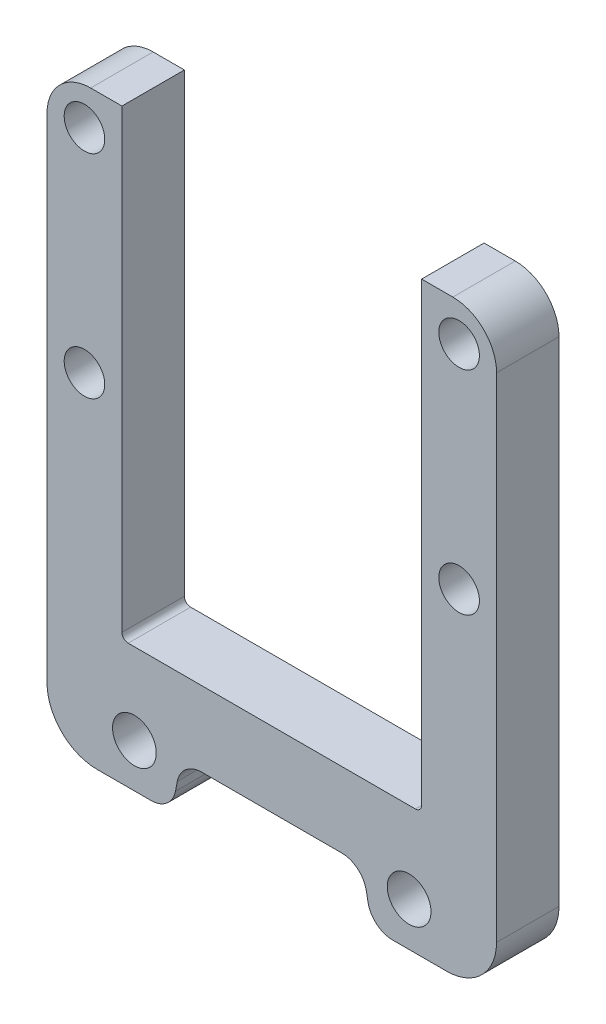
ISO-10303-21;
HEADER;
FILE_DESCRIPTION(('STEP AP214'),'2;1');
FILE_NAME('part.step','',(''),(''),'','','');
FILE_SCHEMA(('AUTOMOTIVE_DESIGN { 1 0 10303 214 1 1 1 1 }'));
ENDSEC;
DATA;
#1=APPLICATION_CONTEXT('core data for automotive mechanical design processes');
#2=APPLICATION_PROTOCOL_DEFINITION('international standard','automotive_design',2000,#1);
#3=PRODUCT_CONTEXT('',#1,'mechanical');
#4=PRODUCT('Part','Part','',(#3));
#5=PRODUCT_RELATED_PRODUCT_CATEGORY('part','',(#4));
#6=PRODUCT_DEFINITION_FORMATION('','',#4);
#7=PRODUCT_DEFINITION_CONTEXT('part definition',#1,'design');
#8=PRODUCT_DEFINITION('design','',#6,#7);
#9=PRODUCT_DEFINITION_SHAPE('','',#8);
#10=(LENGTH_UNIT() NAMED_UNIT(*) SI_UNIT(.MILLI.,.METRE.));
#11=(NAMED_UNIT(*) PLANE_ANGLE_UNIT() SI_UNIT($,.RADIAN.));
#12=(NAMED_UNIT(*) SI_UNIT($,.STERADIAN.) SOLID_ANGLE_UNIT());
#13=UNCERTAINTY_MEASURE_WITH_UNIT(LENGTH_MEASURE(1.E-05),#10,'distance_accuracy_value','');
#14=(GEOMETRIC_REPRESENTATION_CONTEXT(3) GLOBAL_UNCERTAINTY_ASSIGNED_CONTEXT((#13)) GLOBAL_UNIT_ASSIGNED_CONTEXT((#10,
#11,#12)) REPRESENTATION_CONTEXT('',''));
#15=CARTESIAN_POINT('',(0.,0.,0.));
#16=DIRECTION('',(0.,0.,1.));
#17=DIRECTION('',(1.,0.,0.));
#18=AXIS2_PLACEMENT_3D('',#15,#16,#17);
#19=CARTESIAN_POINT('',(0.,0.,10.));
#20=DIRECTION('',(0.,0.,1.));
#21=DIRECTION('',(1.,0.,0.));
#22=AXIS2_PLACEMENT_3D('',#19,#20,#21);
#23=PLANE('',#22);
#24=CARTESIAN_POINT('',(30.,104.,10.));
#25=DIRECTION('',(0.,0.,1.));
#26=DIRECTION('',(1.,0.,0.));
#27=AXIS2_PLACEMENT_3D('',#24,#25,#26);
#28=CIRCLE('',#27,3.24999999999999);
#29=CARTESIAN_POINT('',(33.25,104.,10.));
#30=VERTEX_POINT('',#29);
#31=EDGE_CURVE('E285',#30,#30,#28,.T.);
#32=ORIENTED_EDGE('',*,*,#31,.F.);
#33=EDGE_LOOP('',(#32));
#34=FACE_BOUND('',#33,.T.);
#35=DIRECTION('',(0.,1.,0.));
#36=VECTOR('',#35,1.);
#37=CARTESIAN_POINT('',(36.,16.,10.));
#38=LINE('',#37,#36);
#39=CARTESIAN_POINT('',(36.,24.,10.));
#40=VERTEX_POINT('',#39);
#41=CARTESIAN_POINT('',(36.,103.,10.));
#42=VERTEX_POINT('',#41);
#43=EDGE_CURVE('E321',#40,#42,#38,.T.);
#44=ORIENTED_EDGE('',*,*,#43,.T.);
#45=CARTESIAN_POINT('',(29.,103.,10.));
#46=DIRECTION('',(0.,0.,1.));
#47=DIRECTION('',(1.,0.,0.));
#48=AXIS2_PLACEMENT_3D('',#45,#46,#47);
#49=CIRCLE('',#48,7.);
#50=CARTESIAN_POINT('',(29.,110.,10.));
#51=VERTEX_POINT('',#50);
#52=EDGE_CURVE('E438',#42,#51,#49,.T.);
#53=ORIENTED_EDGE('',*,*,#52,.T.);
#54=DIRECTION('',(-1.,0.,0.));
#55=VECTOR('',#54,1.);
#56=CARTESIAN_POINT('',(36.,110.,10.));
#57=LINE('',#56,#55);
#58=CARTESIAN_POINT('',(24.,110.,10.));
#59=VERTEX_POINT('',#58);
#60=EDGE_CURVE('E299',#51,#59,#57,.T.);
#61=ORIENTED_EDGE('',*,*,#60,.T.);
#62=DIRECTION('',(0.,-1.,0.));
#63=VECTOR('',#62,1.);
#64=CARTESIAN_POINT('',(24.,110.,10.));
#65=LINE('',#64,#63);
#66=CARTESIAN_POINT('',(24.,37.,10.));
#67=VERTEX_POINT('',#66);
#68=EDGE_CURVE('E302',#59,#67,#65,.T.);
#69=ORIENTED_EDGE('',*,*,#68,.T.);
#70=CARTESIAN_POINT('',(23.,37.,10.));
#71=DIRECTION('',(0.,0.,1.));
#72=DIRECTION('',(1.,0.,0.));
#73=AXIS2_PLACEMENT_3D('',#70,#71,#72);
#74=CIRCLE('',#73,1.);
#75=CARTESIAN_POINT('',(23.,36.,10.));
#76=VERTEX_POINT('',#75);
#77=EDGE_CURVE('E11',#67,#76,#74,.F.);
#78=ORIENTED_EDGE('',*,*,#77,.T.);
#79=DIRECTION('',(-1.,0.,0.));
#80=VECTOR('',#79,1.);
#81=CARTESIAN_POINT('',(24.,36.,10.));
#82=LINE('',#81,#80);
#83=CARTESIAN_POINT('',(-23.,36.,10.));
#84=VERTEX_POINT('',#83);
#85=EDGE_CURVE('E306',#76,#84,#82,.T.);
#86=ORIENTED_EDGE('',*,*,#85,.T.);
#87=CARTESIAN_POINT('',(-23.,37.,10.));
#88=DIRECTION('',(0.,0.,1.));
#89=DIRECTION('',(1.,0.,0.));
#90=AXIS2_PLACEMENT_3D('',#87,#88,#89);
#91=CIRCLE('',#90,1.);
#92=CARTESIAN_POINT('',(-24.,37.,10.));
#93=VERTEX_POINT('',#92);
#94=EDGE_CURVE('E243',#84,#93,#91,.F.);
#95=ORIENTED_EDGE('',*,*,#94,.T.);
#96=DIRECTION('',(0.,-1.,0.));
#97=VECTOR('',#96,1.);
#98=CARTESIAN_POINT('',(-24.,110.,10.));
#99=LINE('',#98,#97);
#100=CARTESIAN_POINT('',(-24.,110.,10.));
#101=VERTEX_POINT('',#100);
#102=EDGE_CURVE('E225',#101,#93,#99,.T.);
#103=ORIENTED_EDGE('',*,*,#102,.F.);
#104=DIRECTION('',(1.,0.,0.));
#105=VECTOR('',#104,1.);
#106=CARTESIAN_POINT('',(-36.,110.,10.));
#107=LINE('',#106,#105);
#108=CARTESIAN_POINT('',(-29.,110.,10.));
#109=VERTEX_POINT('',#108);
#110=EDGE_CURVE('E213',#109,#101,#107,.T.);
#111=ORIENTED_EDGE('',*,*,#110,.F.);
#112=CARTESIAN_POINT('',(-29.,103.,10.));
#113=DIRECTION('',(0.,0.,1.));
#114=DIRECTION('',(1.,0.,0.));
#115=AXIS2_PLACEMENT_3D('',#112,#113,#114);
#116=CIRCLE('',#115,7.);
#117=CARTESIAN_POINT('',(-36.,103.,10.));
#118=VERTEX_POINT('',#117);
#119=EDGE_CURVE('E435',#109,#118,#116,.T.);
#120=ORIENTED_EDGE('',*,*,#119,.T.);
#121=DIRECTION('',(0.,1.,0.));
#122=VECTOR('',#121,1.);
#123=CARTESIAN_POINT('',(-36.,16.,10.));
#124=LINE('',#123,#122);
#125=CARTESIAN_POINT('',(-36.,24.,10.));
#126=VERTEX_POINT('',#125);
#127=EDGE_CURVE('E237',#126,#118,#124,.T.);
#128=ORIENTED_EDGE('',*,*,#127,.F.);
#129=CARTESIAN_POINT('',(-28.,24.,10.));
#130=DIRECTION('',(0.,0.,1.));
#131=DIRECTION('',(1.,0.,0.));
#132=AXIS2_PLACEMENT_3D('',#129,#130,#131);
#133=CIRCLE('',#132,8.);
#134=CARTESIAN_POINT('',(-28.,16.,10.));
#135=VERTEX_POINT('',#134);
#136=EDGE_CURVE('E416',#126,#135,#133,.T.);
#137=ORIENTED_EDGE('',*,*,#136,.T.);
#138=DIRECTION('',(-1.,0.,0.));
#139=VECTOR('',#138,1.);
#140=CARTESIAN_POINT('',(-16.0550424731017,16.,10.));
#141=LINE('',#140,#139);
#142=CARTESIAN_POINT('',(-19.3523880163717,16.,10.));
#143=VERTEX_POINT('',#142);
#144=EDGE_CURVE('E250',#143,#135,#141,.T.);
#145=ORIENTED_EDGE('',*,*,#144,.F.);
#146=CARTESIAN_POINT('',(-19.3523880163717,20.,10.));
#147=DIRECTION('',(0.,0.,1.));
#148=DIRECTION('',(1.,0.,0.));
#149=AXIS2_PLACEMENT_3D('',#146,#147,#148);
#150=CIRCLE('',#149,4.);
#151=CARTESIAN_POINT('',(-15.4258792825811,19.2367640184938,10.));
#152=VERTEX_POINT('',#151);
#153=EDGE_CURVE('E368',#143,#152,#150,.T.);
#154=ORIENTED_EDGE('',*,*,#153,.T.);
#155=DIRECTION('',(-0.190808995376542,-0.981627183447665,0.));
#156=VECTOR('',#155,1.);
#157=CARTESIAN_POINT('',(-14.5,24.,10.));
#158=LINE('',#157,#156);
#159=CARTESIAN_POINT('',(-15.1291631905207,20.7632359815062,10.));
#160=VERTEX_POINT('',#159);
#161=EDGE_CURVE('E245',#160,#152,#158,.T.);
#162=ORIENTED_EDGE('',*,*,#161,.F.);
#163=CARTESIAN_POINT('',(-11.20265445673,20.,10.));
#164=DIRECTION('',(0.,0.,1.));
#165=DIRECTION('',(1.,0.,0.));
#166=AXIS2_PLACEMENT_3D('',#163,#164,#165);
#167=CIRCLE('',#166,4.);
#168=CARTESIAN_POINT('',(-11.20265445673,24.,10.));
#169=VERTEX_POINT('',#168);
#170=EDGE_CURVE('E394',#160,#169,#167,.F.);
#171=ORIENTED_EDGE('',*,*,#170,.T.);
#172=DIRECTION('',(1.,0.,0.));
#173=VECTOR('',#172,1.);
#174=CARTESIAN_POINT('',(0.,24.,10.));
#175=LINE('',#174,#173);
#176=CARTESIAN_POINT('',(11.20265445673,24.,10.));
#177=VERTEX_POINT('',#176);
#178=EDGE_CURVE('E309',#169,#177,#175,.T.);
#179=ORIENTED_EDGE('',*,*,#178,.T.);
#180=CARTESIAN_POINT('',(11.20265445673,20.,10.));
#181=DIRECTION('',(0.,0.,1.));
#182=DIRECTION('',(1.,0.,0.));
#183=AXIS2_PLACEMENT_3D('',#180,#181,#182);
#184=CIRCLE('',#183,4.);
#185=CARTESIAN_POINT('',(15.1291631905207,20.7632359815062,10.));
#186=VERTEX_POINT('',#185);
#187=EDGE_CURVE('E400',#177,#186,#184,.F.);
#188=ORIENTED_EDGE('',*,*,#187,.T.);
#189=DIRECTION('',(0.190808995376542,-0.981627183447665,0.));
#190=VECTOR('',#189,1.);
#191=CARTESIAN_POINT('',(14.5,24.,10.));
#192=LINE('',#191,#190);
#193=CARTESIAN_POINT('',(15.4258792825811,19.2367640184938,10.));
#194=VERTEX_POINT('',#193);
#195=EDGE_CURVE('E313',#186,#194,#192,.T.);
#196=ORIENTED_EDGE('',*,*,#195,.T.);
#197=CARTESIAN_POINT('',(19.3523880163717,20.,10.));
#198=DIRECTION('',(0.,0.,1.));
#199=DIRECTION('',(1.,0.,0.));
#200=AXIS2_PLACEMENT_3D('',#197,#198,#199);
#201=CIRCLE('',#200,4.);
#202=CARTESIAN_POINT('',(19.3523880163717,16.,10.));
#203=VERTEX_POINT('',#202);
#204=EDGE_CURVE('E371',#194,#203,#201,.T.);
#205=ORIENTED_EDGE('',*,*,#204,.T.);
#206=DIRECTION('',(1.,0.,0.));
#207=VECTOR('',#206,1.);
#208=CARTESIAN_POINT('',(16.0550424731017,16.,10.));
#209=LINE('',#208,#207);
#210=CARTESIAN_POINT('',(28.,16.,10.));
#211=VERTEX_POINT('',#210);
#212=EDGE_CURVE('E317',#203,#211,#209,.T.);
#213=ORIENTED_EDGE('',*,*,#212,.T.);
#214=CARTESIAN_POINT('',(28.,24.,10.));
#215=DIRECTION('',(0.,0.,1.));
#216=DIRECTION('',(1.,0.,0.));
#217=AXIS2_PLACEMENT_3D('',#214,#215,#216);
#218=CIRCLE('',#217,8.);
#219=EDGE_CURVE('E414',#211,#40,#218,.T.);
#220=ORIENTED_EDGE('',*,*,#219,.T.);
#221=EDGE_LOOP('',(#44,#53,#61,#69,#78,#86,#95,#103,#111,#120,#128,#137,#145,#154,#162,#171,
#179,#188,#196,#205,#213,#220));
#222=FACE_BOUND('',#221,.T.);
#223=CARTESIAN_POINT('',(22.,23.,10.));
#224=DIRECTION('',(0.,0.,1.));
#225=DIRECTION('',(1.,0.,0.));
#226=AXIS2_PLACEMENT_3D('',#223,#224,#225);
#227=CIRCLE('',#226,3.5);
#228=CARTESIAN_POINT('',(25.5,23.,10.));
#229=VERTEX_POINT('',#228);
#230=EDGE_CURVE('E292',#229,#229,#227,.T.);
#231=ORIENTED_EDGE('',*,*,#230,.F.);
#232=EDGE_LOOP('',(#231));
#233=FACE_BOUND('',#232,.T.);
#234=CARTESIAN_POINT('',(30.,70.,10.));
#235=DIRECTION('',(0.,0.,1.));
#236=DIRECTION('',(1.,0.,0.));
#237=AXIS2_PLACEMENT_3D('',#234,#235,#236);
#238=CIRCLE('',#237,3.24999999999999);
#239=CARTESIAN_POINT('',(33.25,70.,10.));
#240=VERTEX_POINT('',#239);
#241=EDGE_CURVE('E277',#240,#240,#238,.T.);
#242=ORIENTED_EDGE('',*,*,#241,.F.);
#243=EDGE_LOOP('',(#242));
#244=FACE_BOUND('',#243,.T.);
#245=CARTESIAN_POINT('',(-30.,104.,10.));
#246=DIRECTION('',(0.,0.,-1.));
#247=DIRECTION('',(-1.,0.,0.));
#248=AXIS2_PLACEMENT_3D('',#245,#246,#247);
#249=CIRCLE('',#248,3.24999999999999);
#250=CARTESIAN_POINT('',(-33.25,104.,10.));
#251=VERTEX_POINT('',#250);
#252=EDGE_CURVE('E641',#251,#251,#249,.T.);
#253=ORIENTED_EDGE('',*,*,#252,.T.);
#254=EDGE_LOOP('',(#253));
#255=FACE_BOUND('',#254,.T.);
#256=CARTESIAN_POINT('',(-22.,23.,10.));
#257=DIRECTION('',(0.,0.,-1.));
#258=DIRECTION('',(-1.,0.,0.));
#259=AXIS2_PLACEMENT_3D('',#256,#257,#258);
#260=CIRCLE('',#259,3.5);
#261=CARTESIAN_POINT('',(-25.5,23.,10.));
#262=VERTEX_POINT('',#261);
#263=EDGE_CURVE('E263',#262,#262,#260,.T.);
#264=ORIENTED_EDGE('',*,*,#263,.T.);
#265=EDGE_LOOP('',(#264));
#266=FACE_BOUND('',#265,.T.);
#267=CARTESIAN_POINT('',(-30.,70.,10.));
#268=DIRECTION('',(0.,0.,-1.));
#269=DIRECTION('',(-1.,0.,0.));
#270=AXIS2_PLACEMENT_3D('',#267,#268,#269);
#271=CIRCLE('',#270,3.24999999999999);
#272=CARTESIAN_POINT('',(-33.25,70.,10.));
#273=VERTEX_POINT('',#272);
#274=EDGE_CURVE('E636',#273,#273,#271,.T.);
#275=ORIENTED_EDGE('',*,*,#274,.T.);
#276=EDGE_LOOP('',(#275));
#277=FACE_BOUND('',#276,.T.);
#278=ADVANCED_FACE('F39',(#34,#222,#233,#244,#255,#266,#277),#23,.T.);
#279=CARTESIAN_POINT('',(0.,0.,0.));
#280=DIRECTION('',(0.,0.,1.));
#281=DIRECTION('',(1.,0.,0.));
#282=AXIS2_PLACEMENT_3D('',#279,#280,#281);
#283=PLANE('',#282);
#284=DIRECTION('',(-1.,0.,0.));
#285=VECTOR('',#284,1.);
#286=CARTESIAN_POINT('',(36.,110.,0.));
#287=LINE('',#286,#285);
#288=CARTESIAN_POINT('',(29.,110.,0.));
#289=VERTEX_POINT('',#288);
#290=CARTESIAN_POINT('',(24.,110.,0.));
#291=VERTEX_POINT('',#290);
#292=EDGE_CURVE('E295',#289,#291,#287,.T.);
#293=ORIENTED_EDGE('',*,*,#292,.F.);
#294=CARTESIAN_POINT('',(29.,103.,0.));
#295=DIRECTION('',(0.,0.,1.));
#296=DIRECTION('',(1.,0.,0.));
#297=AXIS2_PLACEMENT_3D('',#294,#295,#296);
#298=CIRCLE('',#297,7.);
#299=CARTESIAN_POINT('',(36.,103.,0.));
#300=VERTEX_POINT('',#299);
#301=EDGE_CURVE('E430',#289,#300,#298,.F.);
#302=ORIENTED_EDGE('',*,*,#301,.T.);
#303=DIRECTION('',(0.,1.,0.));
#304=VECTOR('',#303,1.);
#305=CARTESIAN_POINT('',(36.,16.,0.));
#306=LINE('',#305,#304);
#307=CARTESIAN_POINT('',(36.,24.,0.));
#308=VERTEX_POINT('',#307);
#309=EDGE_CURVE('E303',#308,#300,#306,.T.);
#310=ORIENTED_EDGE('',*,*,#309,.F.);
#311=CARTESIAN_POINT('',(28.,24.,0.));
#312=DIRECTION('',(0.,0.,1.));
#313=DIRECTION('',(1.,0.,0.));
#314=AXIS2_PLACEMENT_3D('',#311,#312,#313);
#315=CIRCLE('',#314,8.);
#316=CARTESIAN_POINT('',(28.,16.,0.));
#317=VERTEX_POINT('',#316);
#318=EDGE_CURVE('E407',#308,#317,#315,.F.);
#319=ORIENTED_EDGE('',*,*,#318,.T.);
#320=DIRECTION('',(1.,0.,0.));
#321=VECTOR('',#320,1.);
#322=CARTESIAN_POINT('',(16.0550424731017,16.,0.));
#323=LINE('',#322,#321);
#324=CARTESIAN_POINT('',(19.3523880163717,16.,0.));
#325=VERTEX_POINT('',#324);
#326=EDGE_CURVE('E341',#325,#317,#323,.T.);
#327=ORIENTED_EDGE('',*,*,#326,.F.);
#328=CARTESIAN_POINT('',(19.3523880163717,20.,0.));
#329=DIRECTION('',(0.,0.,1.));
#330=DIRECTION('',(1.,0.,0.));
#331=AXIS2_PLACEMENT_3D('',#328,#329,#330);
#332=CIRCLE('',#331,4.);
#333=CARTESIAN_POINT('',(15.4258792825811,19.2367640184938,0.));
#334=VERTEX_POINT('',#333);
#335=EDGE_CURVE('E358',#325,#334,#332,.F.);
#336=ORIENTED_EDGE('',*,*,#335,.T.);
#337=DIRECTION('',(0.190808995376542,-0.981627183447665,0.));
#338=VECTOR('',#337,1.);
#339=CARTESIAN_POINT('',(14.5,24.,0.));
#340=LINE('',#339,#338);
#341=CARTESIAN_POINT('',(15.1291631905207,20.7632359815062,0.));
#342=VERTEX_POINT('',#341);
#343=EDGE_CURVE('E337',#342,#334,#340,.T.);
#344=ORIENTED_EDGE('',*,*,#343,.F.);
#345=CARTESIAN_POINT('',(11.20265445673,20.,0.));
#346=DIRECTION('',(0.,0.,1.));
#347=DIRECTION('',(1.,0.,0.));
#348=AXIS2_PLACEMENT_3D('',#345,#346,#347);
#349=CIRCLE('',#348,4.);
#350=CARTESIAN_POINT('',(11.20265445673,24.,0.));
#351=VERTEX_POINT('',#350);
#352=EDGE_CURVE('E397',#342,#351,#349,.T.);
#353=ORIENTED_EDGE('',*,*,#352,.T.);
#354=DIRECTION('',(1.,0.,0.));
#355=VECTOR('',#354,1.);
#356=CARTESIAN_POINT('',(0.,24.,0.));
#357=LINE('',#356,#355);
#358=CARTESIAN_POINT('',(-11.20265445673,24.,0.));
#359=VERTEX_POINT('',#358);
#360=EDGE_CURVE('E333',#359,#351,#357,.T.);
#361=ORIENTED_EDGE('',*,*,#360,.F.);
#362=CARTESIAN_POINT('',(-11.20265445673,20.,0.));
#363=DIRECTION('',(0.,0.,1.));
#364=DIRECTION('',(1.,0.,0.));
#365=AXIS2_PLACEMENT_3D('',#362,#363,#364);
#366=CIRCLE('',#365,4.);
#367=CARTESIAN_POINT('',(-15.1291631905207,20.7632359815062,0.));
#368=VERTEX_POINT('',#367);
#369=EDGE_CURVE('E391',#359,#368,#366,.T.);
#370=ORIENTED_EDGE('',*,*,#369,.T.);
#371=DIRECTION('',(-0.190808995376542,-0.981627183447665,0.));
#372=VECTOR('',#371,1.);
#373=CARTESIAN_POINT('',(-14.5,24.,0.));
#374=LINE('',#373,#372);
#375=CARTESIAN_POINT('',(-15.4258792825811,19.2367640184938,0.));
#376=VERTEX_POINT('',#375);
#377=EDGE_CURVE('E266',#368,#376,#374,.T.);
#378=ORIENTED_EDGE('',*,*,#377,.T.);
#379=CARTESIAN_POINT('',(-19.3523880163717,20.,0.));
#380=DIRECTION('',(0.,0.,1.));
#381=DIRECTION('',(1.,0.,0.));
#382=AXIS2_PLACEMENT_3D('',#379,#380,#381);
#383=CIRCLE('',#382,4.);
#384=CARTESIAN_POINT('',(-19.3523880163717,16.,0.));
#385=VERTEX_POINT('',#384);
#386=EDGE_CURVE('E355',#376,#385,#383,.F.);
#387=ORIENTED_EDGE('',*,*,#386,.T.);
#388=DIRECTION('',(-1.,0.,0.));
#389=VECTOR('',#388,1.);
#390=CARTESIAN_POINT('',(-16.0550424731017,16.,0.));
#391=LINE('',#390,#389);
#392=CARTESIAN_POINT('',(-28.,16.,0.));
#393=VERTEX_POINT('',#392);
#394=EDGE_CURVE('E270',#385,#393,#391,.T.);
#395=ORIENTED_EDGE('',*,*,#394,.T.);
#396=CARTESIAN_POINT('',(-28.,24.,0.));
#397=DIRECTION('',(0.,0.,1.));
#398=DIRECTION('',(1.,0.,0.));
#399=AXIS2_PLACEMENT_3D('',#396,#397,#398);
#400=CIRCLE('',#399,8.);
#401=CARTESIAN_POINT('',(-36.,24.,0.));
#402=VERTEX_POINT('',#401);
#403=EDGE_CURVE('E409',#393,#402,#400,.F.);
#404=ORIENTED_EDGE('',*,*,#403,.T.);
#405=DIRECTION('',(0.,1.,0.));
#406=VECTOR('',#405,1.);
#407=CARTESIAN_POINT('',(-36.,16.,0.));
#408=LINE('',#407,#406);
#409=CARTESIAN_POINT('',(-36.,103.,0.));
#410=VERTEX_POINT('',#409);
#411=EDGE_CURVE('E226',#402,#410,#408,.T.);
#412=ORIENTED_EDGE('',*,*,#411,.T.);
#413=CARTESIAN_POINT('',(-29.,103.,0.));
#414=DIRECTION('',(0.,0.,1.));
#415=DIRECTION('',(1.,0.,0.));
#416=AXIS2_PLACEMENT_3D('',#413,#414,#415);
#417=CIRCLE('',#416,7.);
#418=CARTESIAN_POINT('',(-29.,110.,0.));
#419=VERTEX_POINT('',#418);
#420=EDGE_CURVE('E427',#410,#419,#417,.F.);
#421=ORIENTED_EDGE('',*,*,#420,.T.);
#422=DIRECTION('',(1.,0.,0.));
#423=VECTOR('',#422,1.);
#424=CARTESIAN_POINT('',(-36.,110.,0.));
#425=LINE('',#424,#423);
#426=CARTESIAN_POINT('',(-24.,110.,0.));
#427=VERTEX_POINT('',#426);
#428=EDGE_CURVE('E260',#419,#427,#425,.T.);
#429=ORIENTED_EDGE('',*,*,#428,.T.);
#430=DIRECTION('',(0.,-1.,0.));
#431=VECTOR('',#430,1.);
#432=CARTESIAN_POINT('',(-24.,110.,0.));
#433=LINE('',#432,#431);
#434=CARTESIAN_POINT('',(-24.,37.,0.));
#435=VERTEX_POINT('',#434);
#436=EDGE_CURVE('E234',#427,#435,#433,.T.);
#437=ORIENTED_EDGE('',*,*,#436,.T.);
#438=CARTESIAN_POINT('',(-23.,37.,0.));
#439=DIRECTION('',(0.,0.,1.));
#440=DIRECTION('',(1.,0.,0.));
#441=AXIS2_PLACEMENT_3D('',#438,#439,#440);
#442=CIRCLE('',#441,1.);
#443=CARTESIAN_POINT('',(-23.,36.,0.));
#444=VERTEX_POINT('',#443);
#445=EDGE_CURVE('E455',#435,#444,#442,.T.);
#446=ORIENTED_EDGE('',*,*,#445,.T.);
#447=DIRECTION('',(-1.,0.,0.));
#448=VECTOR('',#447,1.);
#449=CARTESIAN_POINT('',(24.,36.,0.));
#450=LINE('',#449,#448);
#451=CARTESIAN_POINT('',(23.,36.,0.));
#452=VERTEX_POINT('',#451);
#453=EDGE_CURVE('E329',#452,#444,#450,.T.);
#454=ORIENTED_EDGE('',*,*,#453,.F.);
#455=CARTESIAN_POINT('',(23.,37.,0.));
#456=DIRECTION('',(0.,0.,1.));
#457=DIRECTION('',(1.,0.,0.));
#458=AXIS2_PLACEMENT_3D('',#455,#456,#457);
#459=CIRCLE('',#458,1.);
#460=CARTESIAN_POINT('',(24.,37.,0.));
#461=VERTEX_POINT('',#460);
#462=EDGE_CURVE('E47',#452,#461,#459,.T.);
#463=ORIENTED_EDGE('',*,*,#462,.T.);
#464=DIRECTION('',(0.,-1.,0.));
#465=VECTOR('',#464,1.);
#466=CARTESIAN_POINT('',(24.,110.,0.));
#467=LINE('',#466,#465);
#468=EDGE_CURVE('E326',#291,#461,#467,.T.);
#469=ORIENTED_EDGE('',*,*,#468,.F.);
#470=EDGE_LOOP('',(#293,#302,#310,#319,#327,#336,#344,#353,#361,#370,#378,#387,#395,#404,#412,
#421,#429,#437,#446,#454,#463,#469));
#471=FACE_BOUND('',#470,.T.);
#472=CARTESIAN_POINT('',(22.,23.,0.));
#473=DIRECTION('',(0.,0.,1.));
#474=DIRECTION('',(1.,0.,0.));
#475=AXIS2_PLACEMENT_3D('',#472,#473,#474);
#476=CIRCLE('',#475,3.5);
#477=CARTESIAN_POINT('',(25.5,23.,0.));
#478=VERTEX_POINT('',#477);
#479=EDGE_CURVE('E289',#478,#478,#476,.T.);
#480=ORIENTED_EDGE('',*,*,#479,.T.);
#481=EDGE_LOOP('',(#480));
#482=FACE_BOUND('',#481,.T.);
#483=CARTESIAN_POINT('',(30.,104.,0.));
#484=DIRECTION('',(0.,0.,1.));
#485=DIRECTION('',(1.,0.,0.));
#486=AXIS2_PLACEMENT_3D('',#483,#484,#485);
#487=CIRCLE('',#486,3.24999999999999);
#488=CARTESIAN_POINT('',(33.25,104.,0.));
#489=VERTEX_POINT('',#488);
#490=EDGE_CURVE('E281',#489,#489,#487,.T.);
#491=ORIENTED_EDGE('',*,*,#490,.T.);
#492=EDGE_LOOP('',(#491));
#493=FACE_BOUND('',#492,.T.);
#494=CARTESIAN_POINT('',(30.,70.,0.));
#495=DIRECTION('',(0.,0.,1.));
#496=DIRECTION('',(1.,0.,0.));
#497=AXIS2_PLACEMENT_3D('',#494,#495,#496);
#498=CIRCLE('',#497,3.24999999999999);
#499=CARTESIAN_POINT('',(33.25,70.,0.));
#500=VERTEX_POINT('',#499);
#501=EDGE_CURVE('E236',#500,#500,#498,.T.);
#502=ORIENTED_EDGE('',*,*,#501,.T.);
#503=EDGE_LOOP('',(#502));
#504=FACE_BOUND('',#503,.T.);
#505=CARTESIAN_POINT('',(-22.,23.,0.));
#506=DIRECTION('',(0.,0.,-1.));
#507=DIRECTION('',(-1.,0.,0.));
#508=AXIS2_PLACEMENT_3D('',#505,#506,#507);
#509=CIRCLE('',#508,3.5);
#510=CARTESIAN_POINT('',(-25.5,23.,0.));
#511=VERTEX_POINT('',#510);
#512=EDGE_CURVE('E626',#511,#511,#509,.T.);
#513=ORIENTED_EDGE('',*,*,#512,.F.);
#514=EDGE_LOOP('',(#513));
#515=FACE_BOUND('',#514,.T.);
#516=CARTESIAN_POINT('',(-30.,104.,0.));
#517=DIRECTION('',(0.,0.,-1.));
#518=DIRECTION('',(-1.,0.,0.));
#519=AXIS2_PLACEMENT_3D('',#516,#517,#518);
#520=CIRCLE('',#519,3.24999999999999);
#521=CARTESIAN_POINT('',(-33.25,104.,0.));
#522=VERTEX_POINT('',#521);
#523=EDGE_CURVE('E630',#522,#522,#520,.T.);
#524=ORIENTED_EDGE('',*,*,#523,.F.);
#525=EDGE_LOOP('',(#524));
#526=FACE_BOUND('',#525,.T.);
#527=CARTESIAN_POINT('',(-30.,70.,0.));
#528=DIRECTION('',(0.,0.,-1.));
#529=DIRECTION('',(-1.,0.,0.));
#530=AXIS2_PLACEMENT_3D('',#527,#528,#529);
#531=CIRCLE('',#530,3.24999999999999);
#532=CARTESIAN_POINT('',(-33.25,70.,0.));
#533=VERTEX_POINT('',#532);
#534=EDGE_CURVE('E633',#533,#533,#531,.T.);
#535=ORIENTED_EDGE('',*,*,#534,.F.);
#536=EDGE_LOOP('',(#535));
#537=FACE_BOUND('',#536,.T.);
#538=ADVANCED_FACE('F458',(#471,#482,#493,#504,#515,#526,#537),#283,.F.);
#539=CARTESIAN_POINT('',(36.,110.,10.));
#540=DIRECTION('',(0.,-1.,0.));
#541=DIRECTION('',(0.,0.,-1.));
#542=AXIS2_PLACEMENT_3D('',#539,#540,#541);
#543=PLANE('',#542);
#544=ORIENTED_EDGE('',*,*,#60,.F.);
#545=DIRECTION('',(0.,0.,-1.));
#546=VECTOR('',#545,1.);
#547=CARTESIAN_POINT('',(29.,110.,10.));
#548=LINE('',#547,#546);
#549=EDGE_CURVE('E423',#51,#289,#548,.T.);
#550=ORIENTED_EDGE('',*,*,#549,.T.);
#551=ORIENTED_EDGE('',*,*,#292,.T.);
#552=DIRECTION('',(0.,0.,-1.));
#553=VECTOR('',#552,1.);
#554=CARTESIAN_POINT('',(24.,110.,10.));
#555=LINE('',#554,#553);
#556=EDGE_CURVE('E324',#59,#291,#555,.T.);
#557=ORIENTED_EDGE('',*,*,#556,.F.);
#558=EDGE_LOOP('',(#544,#550,#551,#557));
#559=FACE_BOUND('',#558,.T.);
#560=ADVANCED_FACE('F483',(#559),#543,.F.);
#561=CARTESIAN_POINT('',(24.,110.,10.));
#562=DIRECTION('',(1.,0.,0.));
#563=DIRECTION('',(0.,1.,0.));
#564=AXIS2_PLACEMENT_3D('',#561,#562,#563);
#565=PLANE('',#564);
#566=ORIENTED_EDGE('',*,*,#468,.T.);
#567=DIRECTION('',(0.,0.,-1.));
#568=VECTOR('',#567,1.);
#569=CARTESIAN_POINT('',(24.,37.,10.));
#570=LINE('',#569,#568);
#571=EDGE_CURVE('E54',#461,#67,#570,.F.);
#572=ORIENTED_EDGE('',*,*,#571,.T.);
#573=ORIENTED_EDGE('',*,*,#68,.F.);
#574=ORIENTED_EDGE('',*,*,#556,.T.);
#575=EDGE_LOOP('',(#566,#572,#573,#574));
#576=FACE_BOUND('',#575,.T.);
#577=ADVANCED_FACE('F508',(#576),#565,.F.);
#578=CARTESIAN_POINT('',(24.,36.,10.));
#579=DIRECTION('',(0.,-1.,0.));
#580=DIRECTION('',(1.,0.,0.));
#581=AXIS2_PLACEMENT_3D('',#578,#579,#580);
#582=PLANE('',#581);
#583=ORIENTED_EDGE('',*,*,#453,.T.);
#584=DIRECTION('',(0.,0.,-1.));
#585=VECTOR('',#584,1.);
#586=CARTESIAN_POINT('',(-23.,36.,10.));
#587=LINE('',#586,#585);
#588=EDGE_CURVE('E452',#444,#84,#587,.F.);
#589=ORIENTED_EDGE('',*,*,#588,.T.);
#590=ORIENTED_EDGE('',*,*,#85,.F.);
#591=DIRECTION('',(0.,0.,-1.));
#592=VECTOR('',#591,1.);
#593=CARTESIAN_POINT('',(23.,36.,0.));
#594=LINE('',#593,#592);
#595=EDGE_CURVE('E449',#76,#452,#594,.T.);
#596=ORIENTED_EDGE('',*,*,#595,.T.);
#597=EDGE_LOOP('',(#583,#589,#590,#596));
#598=FACE_BOUND('',#597,.T.);
#599=ADVANCED_FACE('F463',(#598),#582,.F.);
#600=CARTESIAN_POINT('',(0.,24.,10.));
#601=DIRECTION('',(0.,1.,0.));
#602=DIRECTION('',(0.,0.,1.));
#603=AXIS2_PLACEMENT_3D('',#600,#601,#602);
#604=PLANE('',#603);
#605=ORIENTED_EDGE('',*,*,#178,.F.);
#606=DIRECTION('',(0.,0.,-1.));
#607=VECTOR('',#606,1.);
#608=CARTESIAN_POINT('',(-11.20265445673,24.,0.));
#609=LINE('',#608,#607);
#610=EDGE_CURVE('E387',#169,#359,#609,.T.);
#611=ORIENTED_EDGE('',*,*,#610,.T.);
#612=ORIENTED_EDGE('',*,*,#360,.T.);
#613=DIRECTION('',(0.,0.,-1.));
#614=VECTOR('',#613,1.);
#615=CARTESIAN_POINT('',(11.20265445673,24.,10.));
#616=LINE('',#615,#614);
#617=EDGE_CURVE('E384',#351,#177,#616,.F.);
#618=ORIENTED_EDGE('',*,*,#617,.T.);
#619=EDGE_LOOP('',(#605,#611,#612,#618));
#620=FACE_BOUND('',#619,.T.);
#621=ADVANCED_FACE('F501',(#620),#604,.F.);
#622=CARTESIAN_POINT('',(14.5,24.,10.));
#623=DIRECTION('',(0.981627183447665,0.190808995376542,0.));
#624=DIRECTION('',(-0.190808995376542,0.981627183447665,0.));
#625=AXIS2_PLACEMENT_3D('',#622,#623,#624);
#626=PLANE('',#625);
#627=ORIENTED_EDGE('',*,*,#343,.T.);
#628=DIRECTION('',(0.,0.,-1.));
#629=VECTOR('',#628,1.);
#630=CARTESIAN_POINT('',(15.4258792825811,19.2367640184938,10.));
#631=LINE('',#630,#629);
#632=EDGE_CURVE('E365',#334,#194,#631,.F.);
#633=ORIENTED_EDGE('',*,*,#632,.T.);
#634=ORIENTED_EDGE('',*,*,#195,.F.);
#635=DIRECTION('',(0.,0.,-1.));
#636=VECTOR('',#635,1.);
#637=CARTESIAN_POINT('',(15.1291631905207,20.7632359815062,0.));
#638=LINE('',#637,#636);
#639=EDGE_CURVE('E361',#186,#342,#638,.T.);
#640=ORIENTED_EDGE('',*,*,#639,.T.);
#641=EDGE_LOOP('',(#627,#633,#634,#640));
#642=FACE_BOUND('',#641,.T.);
#643=ADVANCED_FACE('F497',(#642),#626,.F.);
#644=CARTESIAN_POINT('',(16.0550424731017,16.,10.));
#645=DIRECTION('',(0.,1.,0.));
#646=DIRECTION('',(0.,0.,1.));
#647=AXIS2_PLACEMENT_3D('',#644,#645,#646);
#648=PLANE('',#647);
#649=ORIENTED_EDGE('',*,*,#326,.T.);
#650=DIRECTION('',(0.,0.,-1.));
#651=VECTOR('',#650,1.);
#652=CARTESIAN_POINT('',(28.,16.,10.));
#653=LINE('',#652,#651);
#654=EDGE_CURVE('E421',#317,#211,#653,.F.);
#655=ORIENTED_EDGE('',*,*,#654,.T.);
#656=ORIENTED_EDGE('',*,*,#212,.F.);
#657=DIRECTION('',(0.,0.,-1.));
#658=VECTOR('',#657,1.);
#659=CARTESIAN_POINT('',(19.3523880163717,16.,10.));
#660=LINE('',#659,#658);
#661=EDGE_CURVE('E351',#203,#325,#660,.T.);
#662=ORIENTED_EDGE('',*,*,#661,.T.);
#663=EDGE_LOOP('',(#649,#655,#656,#662));
#664=FACE_BOUND('',#663,.T.);
#665=ADVANCED_FACE('F493',(#664),#648,.F.);
#666=CARTESIAN_POINT('',(36.,16.,10.));
#667=DIRECTION('',(-1.,0.,0.));
#668=DIRECTION('',(0.,0.,1.));
#669=AXIS2_PLACEMENT_3D('',#666,#667,#668);
#670=PLANE('',#669);
#671=ORIENTED_EDGE('',*,*,#309,.T.);
#672=DIRECTION('',(0.,0.,-1.));
#673=VECTOR('',#672,1.);
#674=CARTESIAN_POINT('',(36.,103.,10.));
#675=LINE('',#674,#673);
#676=EDGE_CURVE('E432',#300,#42,#675,.F.);
#677=ORIENTED_EDGE('',*,*,#676,.T.);
#678=ORIENTED_EDGE('',*,*,#43,.F.);
#679=DIRECTION('',(0.,0.,-1.));
#680=VECTOR('',#679,1.);
#681=CARTESIAN_POINT('',(36.,24.,10.));
#682=LINE('',#681,#680);
#683=EDGE_CURVE('E418',#40,#308,#682,.T.);
#684=ORIENTED_EDGE('',*,*,#683,.T.);
#685=EDGE_LOOP('',(#671,#677,#678,#684));
#686=FACE_BOUND('',#685,.T.);
#687=ADVANCED_FACE('F490',(#686),#670,.F.);
#688=CARTESIAN_POINT('',(22.,23.,10.));
#689=DIRECTION('',(0.,0.,-1.));
#690=DIRECTION('',(-1.,0.,0.));
#691=AXIS2_PLACEMENT_3D('',#688,#689,#690);
#692=CYLINDRICAL_SURFACE('',#691,3.5);
#693=ORIENTED_EDGE('',*,*,#230,.T.);
#694=EDGE_LOOP('',(#693));
#695=FACE_BOUND('',#694,.T.);
#696=ORIENTED_EDGE('',*,*,#479,.F.);
#697=EDGE_LOOP('',(#696));
#698=FACE_BOUND('',#697,.T.);
#699=ADVANCED_FACE('F487',(#695,#698),#692,.F.);
#700=CARTESIAN_POINT('',(30.,104.,10.));
#701=DIRECTION('',(0.,0.,-1.));
#702=DIRECTION('',(-1.,0.,0.));
#703=AXIS2_PLACEMENT_3D('',#700,#701,#702);
#704=CYLINDRICAL_SURFACE('',#703,3.24999999999999);
#705=ORIENTED_EDGE('',*,*,#31,.T.);
#706=EDGE_LOOP('',(#705));
#707=FACE_BOUND('',#706,.T.);
#708=ORIENTED_EDGE('',*,*,#490,.F.);
#709=EDGE_LOOP('',(#708));
#710=FACE_BOUND('',#709,.T.);
#711=ADVANCED_FACE('F609',(#707,#710),#704,.F.);
#712=CARTESIAN_POINT('',(30.,70.,10.));
#713=DIRECTION('',(0.,0.,-1.));
#714=DIRECTION('',(-1.,0.,0.));
#715=AXIS2_PLACEMENT_3D('',#712,#713,#714);
#716=CYLINDRICAL_SURFACE('',#715,3.24999999999999);
#717=ORIENTED_EDGE('',*,*,#241,.T.);
#718=EDGE_LOOP('',(#717));
#719=FACE_BOUND('',#718,.T.);
#720=ORIENTED_EDGE('',*,*,#501,.F.);
#721=EDGE_LOOP('',(#720));
#722=FACE_BOUND('',#721,.T.);
#723=ADVANCED_FACE('F607',(#719,#722),#716,.F.);
#724=CARTESIAN_POINT('',(-36.,110.,10.));
#725=DIRECTION('',(0.,-1.,0.));
#726=DIRECTION('',(0.,0.,-1.));
#727=AXIS2_PLACEMENT_3D('',#724,#725,#726);
#728=PLANE('',#727);
#729=ORIENTED_EDGE('',*,*,#428,.F.);
#730=DIRECTION('',(0.,0.,-1.));
#731=VECTOR('',#730,1.);
#732=CARTESIAN_POINT('',(-29.,110.,10.));
#733=LINE('',#732,#731);
#734=EDGE_CURVE('E220',#419,#109,#733,.F.);
#735=ORIENTED_EDGE('',*,*,#734,.T.);
#736=ORIENTED_EDGE('',*,*,#110,.T.);
#737=DIRECTION('',(0.,0.,-1.));
#738=VECTOR('',#737,1.);
#739=CARTESIAN_POINT('',(-24.,110.,10.));
#740=LINE('',#739,#738);
#741=EDGE_CURVE('E217',#101,#427,#740,.T.);
#742=ORIENTED_EDGE('',*,*,#741,.T.);
#743=EDGE_LOOP('',(#729,#735,#736,#742));
#744=FACE_BOUND('',#743,.T.);
#745=ADVANCED_FACE('F216',(#744),#728,.F.);
#746=CARTESIAN_POINT('',(-24.,110.,10.));
#747=DIRECTION('',(-1.,0.,0.));
#748=DIRECTION('',(0.,1.,0.));
#749=AXIS2_PLACEMENT_3D('',#746,#747,#748);
#750=PLANE('',#749);
#751=ORIENTED_EDGE('',*,*,#102,.T.);
#752=DIRECTION('',(0.,0.,-1.));
#753=VECTOR('',#752,1.);
#754=CARTESIAN_POINT('',(-24.,37.,0.));
#755=LINE('',#754,#753);
#756=EDGE_CURVE('E447',#93,#435,#755,.T.);
#757=ORIENTED_EDGE('',*,*,#756,.T.);
#758=ORIENTED_EDGE('',*,*,#436,.F.);
#759=ORIENTED_EDGE('',*,*,#741,.F.);
#760=EDGE_LOOP('',(#751,#757,#758,#759));
#761=FACE_BOUND('',#760,.T.);
#762=ADVANCED_FACE('F230',(#761),#750,.F.);
#763=CARTESIAN_POINT('',(-14.5,24.,10.));
#764=DIRECTION('',(-0.981627183447665,0.190808995376542,0.));
#765=DIRECTION('',(0.190808995376542,0.981627183447665,0.));
#766=AXIS2_PLACEMENT_3D('',#763,#764,#765);
#767=PLANE('',#766);
#768=ORIENTED_EDGE('',*,*,#161,.T.);
#769=DIRECTION('',(0.,0.,-1.));
#770=VECTOR('',#769,1.);
#771=CARTESIAN_POINT('',(-15.4258792825811,19.2367640184938,10.));
#772=LINE('',#771,#770);
#773=EDGE_CURVE('E377',#152,#376,#772,.T.);
#774=ORIENTED_EDGE('',*,*,#773,.T.);
#775=ORIENTED_EDGE('',*,*,#377,.F.);
#776=DIRECTION('',(0.,0.,-1.));
#777=VECTOR('',#776,1.);
#778=CARTESIAN_POINT('',(-15.1291631905207,20.7632359815062,10.));
#779=LINE('',#778,#777);
#780=EDGE_CURVE('E374',#368,#160,#779,.F.);
#781=ORIENTED_EDGE('',*,*,#780,.T.);
#782=EDGE_LOOP('',(#768,#774,#775,#781));
#783=FACE_BOUND('',#782,.T.);
#784=ADVANCED_FACE('F571',(#783),#767,.F.);
#785=CARTESIAN_POINT('',(-16.0550424731017,16.,10.));
#786=DIRECTION('',(0.,1.,0.));
#787=DIRECTION('',(0.,0.,1.));
#788=AXIS2_PLACEMENT_3D('',#785,#786,#787);
#789=PLANE('',#788);
#790=ORIENTED_EDGE('',*,*,#144,.T.);
#791=DIRECTION('',(0.,0.,-1.));
#792=VECTOR('',#791,1.);
#793=CARTESIAN_POINT('',(-28.,16.,10.));
#794=LINE('',#793,#792);
#795=EDGE_CURVE('E403',#135,#393,#794,.T.);
#796=ORIENTED_EDGE('',*,*,#795,.T.);
#797=ORIENTED_EDGE('',*,*,#394,.F.);
#798=DIRECTION('',(0.,0.,-1.));
#799=VECTOR('',#798,1.);
#800=CARTESIAN_POINT('',(-19.3523880163717,16.,10.));
#801=LINE('',#800,#799);
#802=EDGE_CURVE('E381',#385,#143,#801,.F.);
#803=ORIENTED_EDGE('',*,*,#802,.T.);
#804=EDGE_LOOP('',(#790,#796,#797,#803));
#805=FACE_BOUND('',#804,.T.);
#806=ADVANCED_FACE('F578',(#805),#789,.F.);
#807=CARTESIAN_POINT('',(-36.,16.,10.));
#808=DIRECTION('',(1.,0.,0.));
#809=DIRECTION('',(0.,0.,1.));
#810=AXIS2_PLACEMENT_3D('',#807,#808,#809);
#811=PLANE('',#810);
#812=ORIENTED_EDGE('',*,*,#127,.T.);
#813=DIRECTION('',(0.,0.,-1.));
#814=VECTOR('',#813,1.);
#815=CARTESIAN_POINT('',(-36.,103.,10.));
#816=LINE('',#815,#814);
#817=EDGE_CURVE('E441',#118,#410,#816,.T.);
#818=ORIENTED_EDGE('',*,*,#817,.T.);
#819=ORIENTED_EDGE('',*,*,#411,.F.);
#820=DIRECTION('',(0.,0.,-1.));
#821=VECTOR('',#820,1.);
#822=CARTESIAN_POINT('',(-36.,24.,10.));
#823=LINE('',#822,#821);
#824=EDGE_CURVE('E412',#402,#126,#823,.F.);
#825=ORIENTED_EDGE('',*,*,#824,.T.);
#826=EDGE_LOOP('',(#812,#818,#819,#825));
#827=FACE_BOUND('',#826,.T.);
#828=ADVANCED_FACE('F585',(#827),#811,.F.);
#829=CARTESIAN_POINT('',(-22.,23.,10.));
#830=DIRECTION('',(0.,0.,-1.));
#831=DIRECTION('',(1.,0.,0.));
#832=AXIS2_PLACEMENT_3D('',#829,#830,#831);
#833=CYLINDRICAL_SURFACE('',#832,3.5);
#834=ORIENTED_EDGE('',*,*,#263,.F.);
#835=EDGE_LOOP('',(#834));
#836=FACE_BOUND('',#835,.T.);
#837=ORIENTED_EDGE('',*,*,#512,.T.);
#838=EDGE_LOOP('',(#837));
#839=FACE_BOUND('',#838,.T.);
#840=ADVANCED_FACE('F589',(#836,#839),#833,.F.);
#841=CARTESIAN_POINT('',(-30.,104.,10.));
#842=DIRECTION('',(0.,0.,-1.));
#843=DIRECTION('',(1.,0.,0.));
#844=AXIS2_PLACEMENT_3D('',#841,#842,#843);
#845=CYLINDRICAL_SURFACE('',#844,3.24999999999999);
#846=ORIENTED_EDGE('',*,*,#252,.F.);
#847=EDGE_LOOP('',(#846));
#848=FACE_BOUND('',#847,.T.);
#849=ORIENTED_EDGE('',*,*,#523,.T.);
#850=EDGE_LOOP('',(#849));
#851=FACE_BOUND('',#850,.T.);
#852=ADVANCED_FACE('F595',(#848,#851),#845,.F.);
#853=CARTESIAN_POINT('',(-30.,70.,10.));
#854=DIRECTION('',(0.,0.,-1.));
#855=DIRECTION('',(1.,0.,0.));
#856=AXIS2_PLACEMENT_3D('',#853,#854,#855);
#857=CYLINDRICAL_SURFACE('',#856,3.24999999999999);
#858=ORIENTED_EDGE('',*,*,#274,.F.);
#859=EDGE_LOOP('',(#858));
#860=FACE_BOUND('',#859,.T.);
#861=ORIENTED_EDGE('',*,*,#534,.T.);
#862=EDGE_LOOP('',(#861));
#863=FACE_BOUND('',#862,.T.);
#864=ADVANCED_FACE('F518',(#860,#863),#857,.F.);
#865=CARTESIAN_POINT('',(19.3523880163717,20.,10.));
#866=DIRECTION('',(0.,0.,-1.));
#867=DIRECTION('',(-1.,0.,0.));
#868=AXIS2_PLACEMENT_3D('',#865,#866,#867);
#869=CYLINDRICAL_SURFACE('',#868,4.);
#870=ORIENTED_EDGE('',*,*,#204,.F.);
#871=ORIENTED_EDGE('',*,*,#632,.F.);
#872=ORIENTED_EDGE('',*,*,#335,.F.);
#873=ORIENTED_EDGE('',*,*,#661,.F.);
#874=EDGE_LOOP('',(#870,#871,#872,#873));
#875=FACE_BOUND('',#874,.T.);
#876=ADVANCED_FACE('F514',(#875),#869,.T.);
#877=CARTESIAN_POINT('',(-19.3523880163717,20.,10.));
#878=DIRECTION('',(0.,0.,-1.));
#879=DIRECTION('',(-1.,0.,0.));
#880=AXIS2_PLACEMENT_3D('',#877,#878,#879);
#881=CYLINDRICAL_SURFACE('',#880,4.);
#882=ORIENTED_EDGE('',*,*,#153,.F.);
#883=ORIENTED_EDGE('',*,*,#802,.F.);
#884=ORIENTED_EDGE('',*,*,#386,.F.);
#885=ORIENTED_EDGE('',*,*,#773,.F.);
#886=EDGE_LOOP('',(#882,#883,#884,#885));
#887=FACE_BOUND('',#886,.T.);
#888=ADVANCED_FACE('F517',(#887),#881,.T.);
#889=CARTESIAN_POINT('',(-11.20265445673,20.,10.));
#890=DIRECTION('',(0.,0.,1.));
#891=DIRECTION('',(1.,0.,0.));
#892=AXIS2_PLACEMENT_3D('',#889,#890,#891);
#893=CYLINDRICAL_SURFACE('',#892,4.);
#894=ORIENTED_EDGE('',*,*,#170,.F.);
#895=ORIENTED_EDGE('',*,*,#780,.F.);
#896=ORIENTED_EDGE('',*,*,#369,.F.);
#897=ORIENTED_EDGE('',*,*,#610,.F.);
#898=EDGE_LOOP('',(#894,#895,#896,#897));
#899=FACE_BOUND('',#898,.T.);
#900=ADVANCED_FACE('F522',(#899),#893,.F.);
#901=CARTESIAN_POINT('',(11.20265445673,20.,10.));
#902=DIRECTION('',(0.,0.,1.));
#903=DIRECTION('',(1.,0.,0.));
#904=AXIS2_PLACEMENT_3D('',#901,#902,#903);
#905=CYLINDRICAL_SURFACE('',#904,4.);
#906=ORIENTED_EDGE('',*,*,#187,.F.);
#907=ORIENTED_EDGE('',*,*,#617,.F.);
#908=ORIENTED_EDGE('',*,*,#352,.F.);
#909=ORIENTED_EDGE('',*,*,#639,.F.);
#910=EDGE_LOOP('',(#906,#907,#908,#909));
#911=FACE_BOUND('',#910,.T.);
#912=ADVANCED_FACE('F526',(#911),#905,.F.);
#913=CARTESIAN_POINT('',(-28.,24.,10.));
#914=DIRECTION('',(0.,0.,-1.));
#915=DIRECTION('',(-1.,0.,0.));
#916=AXIS2_PLACEMENT_3D('',#913,#914,#915);
#917=CYLINDRICAL_SURFACE('',#916,8.);
#918=ORIENTED_EDGE('',*,*,#136,.F.);
#919=ORIENTED_EDGE('',*,*,#824,.F.);
#920=ORIENTED_EDGE('',*,*,#403,.F.);
#921=ORIENTED_EDGE('',*,*,#795,.F.);
#922=EDGE_LOOP('',(#918,#919,#920,#921));
#923=FACE_BOUND('',#922,.T.);
#924=ADVANCED_FACE('F530',(#923),#917,.T.);
#925=CARTESIAN_POINT('',(28.,24.,10.));
#926=DIRECTION('',(0.,0.,-1.));
#927=DIRECTION('',(-1.,0.,0.));
#928=AXIS2_PLACEMENT_3D('',#925,#926,#927);
#929=CYLINDRICAL_SURFACE('',#928,8.);
#930=ORIENTED_EDGE('',*,*,#219,.F.);
#931=ORIENTED_EDGE('',*,*,#654,.F.);
#932=ORIENTED_EDGE('',*,*,#318,.F.);
#933=ORIENTED_EDGE('',*,*,#683,.F.);
#934=EDGE_LOOP('',(#930,#931,#932,#933));
#935=FACE_BOUND('',#934,.T.);
#936=ADVANCED_FACE('F534',(#935),#929,.T.);
#937=CARTESIAN_POINT('',(29.,103.,10.));
#938=DIRECTION('',(0.,0.,-1.));
#939=DIRECTION('',(-1.,0.,0.));
#940=AXIS2_PLACEMENT_3D('',#937,#938,#939);
#941=CYLINDRICAL_SURFACE('',#940,7.);
#942=ORIENTED_EDGE('',*,*,#52,.F.);
#943=ORIENTED_EDGE('',*,*,#676,.F.);
#944=ORIENTED_EDGE('',*,*,#301,.F.);
#945=ORIENTED_EDGE('',*,*,#549,.F.);
#946=EDGE_LOOP('',(#942,#943,#944,#945));
#947=FACE_BOUND('',#946,.T.);
#948=ADVANCED_FACE('F474',(#947),#941,.T.);
#949=CARTESIAN_POINT('',(-29.,103.,10.));
#950=DIRECTION('',(0.,0.,-1.));
#951=DIRECTION('',(-1.,0.,0.));
#952=AXIS2_PLACEMENT_3D('',#949,#950,#951);
#953=CYLINDRICAL_SURFACE('',#952,7.);
#954=ORIENTED_EDGE('',*,*,#119,.F.);
#955=ORIENTED_EDGE('',*,*,#734,.F.);
#956=ORIENTED_EDGE('',*,*,#420,.F.);
#957=ORIENTED_EDGE('',*,*,#817,.F.);
#958=EDGE_LOOP('',(#954,#955,#956,#957));
#959=FACE_BOUND('',#958,.T.);
#960=ADVANCED_FACE('F468',(#959),#953,.T.);
#961=CARTESIAN_POINT('',(-23.,37.,10.));
#962=DIRECTION('',(0.,0.,1.));
#963=DIRECTION('',(1.,0.,0.));
#964=AXIS2_PLACEMENT_3D('',#961,#962,#963);
#965=CYLINDRICAL_SURFACE('',#964,1.);
#966=ORIENTED_EDGE('',*,*,#94,.F.);
#967=ORIENTED_EDGE('',*,*,#588,.F.);
#968=ORIENTED_EDGE('',*,*,#445,.F.);
#969=ORIENTED_EDGE('',*,*,#756,.F.);
#970=EDGE_LOOP('',(#966,#967,#968,#969));
#971=FACE_BOUND('',#970,.T.);
#972=ADVANCED_FACE('F466',(#971),#965,.F.);
#973=CARTESIAN_POINT('',(23.,37.,10.));
#974=DIRECTION('',(0.,0.,1.));
#975=DIRECTION('',(1.,0.,0.));
#976=AXIS2_PLACEMENT_3D('',#973,#974,#975);
#977=CYLINDRICAL_SURFACE('',#976,1.);
#978=ORIENTED_EDGE('',*,*,#77,.F.);
#979=ORIENTED_EDGE('',*,*,#571,.F.);
#980=ORIENTED_EDGE('',*,*,#462,.F.);
#981=ORIENTED_EDGE('',*,*,#595,.F.);
#982=EDGE_LOOP('',(#978,#979,#980,#981));
#983=FACE_BOUND('',#982,.T.);
#984=ADVANCED_FACE('F41',(#983),#977,.F.);
#985=CLOSED_SHELL('',(#278,#538,#560,#577,#599,#621,#643,#665,#687,#699,#711,#723,#745,#762,
#784,#806,#828,#840,#852,#864,#876,#888,#900,#912,#924,#936,#948,#960,#972,#984));
#986=MANIFOLD_SOLID_BREP('B2',#985);
#987=ADVANCED_BREP_SHAPE_REPRESENTATION('',(#18,#986),#14);
#988=SHAPE_DEFINITION_REPRESENTATION(#9,#987);
ENDSEC;
END-ISO-10303-21;
